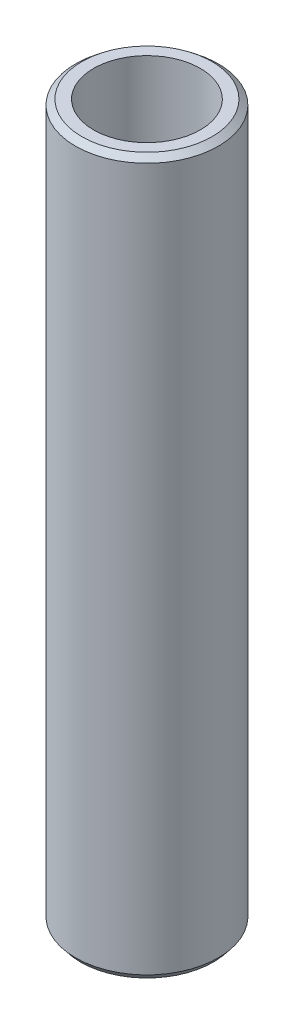
ISO-10303-21;
HEADER;
FILE_DESCRIPTION(('STEP AP214'),'2;1');
FILE_NAME('part.step','',(''),(''),'','','');
FILE_SCHEMA(('AUTOMOTIVE_DESIGN { 1 0 10303 214 1 1 1 1 }'));
ENDSEC;
DATA;
#1=APPLICATION_CONTEXT('core data for automotive mechanical design processes');
#2=APPLICATION_PROTOCOL_DEFINITION('international standard','automotive_design',2000,#1);
#3=PRODUCT_CONTEXT('',#1,'mechanical');
#4=PRODUCT('Part','Part','',(#3));
#5=PRODUCT_RELATED_PRODUCT_CATEGORY('part','',(#4));
#6=PRODUCT_DEFINITION_FORMATION('','',#4);
#7=PRODUCT_DEFINITION_CONTEXT('part definition',#1,'design');
#8=PRODUCT_DEFINITION('design','',#6,#7);
#9=PRODUCT_DEFINITION_SHAPE('','',#8);
#10=(LENGTH_UNIT() NAMED_UNIT(*) SI_UNIT(.MILLI.,.METRE.));
#11=(NAMED_UNIT(*) PLANE_ANGLE_UNIT() SI_UNIT($,.RADIAN.));
#12=(NAMED_UNIT(*) SI_UNIT($,.STERADIAN.) SOLID_ANGLE_UNIT());
#13=UNCERTAINTY_MEASURE_WITH_UNIT(LENGTH_MEASURE(1.E-05),#10,'distance_accuracy_value','');
#14=(GEOMETRIC_REPRESENTATION_CONTEXT(3) GLOBAL_UNCERTAINTY_ASSIGNED_CONTEXT((#13)) GLOBAL_UNIT_ASSIGNED_CONTEXT((#10,
#11,#12)) REPRESENTATION_CONTEXT('',''));
#15=CARTESIAN_POINT('',(0.,0.,0.));
#16=DIRECTION('',(0.,0.,1.));
#17=DIRECTION('',(1.,0.,0.));
#18=AXIS2_PLACEMENT_3D('',#15,#16,#17);
#19=CARTESIAN_POINT('',(0.,550.169340754739,0.));
#20=DIRECTION('',(0.,-1.,0.));
#21=DIRECTION('',(0.,0.,-1.));
#22=AXIS2_PLACEMENT_3D('',#19,#20,#21);
#23=CYLINDRICAL_SURFACE('',#22,55.);
#24=CARTESIAN_POINT('',(0.,546.255478460157,0.));
#25=DIRECTION('',(0.,1.,0.));
#26=DIRECTION('',(0.,0.,1.));
#27=AXIS2_PLACEMENT_3D('',#24,#25,#26);
#28=CIRCLE('',#27,55.);
#29=CARTESIAN_POINT('',(0.,546.255478460157,55.));
#30=VERTEX_POINT('',#29);
#31=EDGE_CURVE('E50',#30,#30,#28,.F.);
#32=ORIENTED_EDGE('',*,*,#31,.T.);
#33=EDGE_LOOP('',(#32));
#34=FACE_BOUND('',#33,.T.);
#35=CARTESIAN_POINT('',(0.,4.86034347771835,0.));
#36=DIRECTION('',(0.,1.,0.));
#37=DIRECTION('',(0.,0.,1.));
#38=AXIS2_PLACEMENT_3D('',#35,#36,#37);
#39=CIRCLE('',#38,55.);
#40=CARTESIAN_POINT('',(0.,4.86034347771835,55.));
#41=VERTEX_POINT('',#40);
#42=EDGE_CURVE('E51',#41,#41,#39,.T.);
#43=ORIENTED_EDGE('',*,*,#42,.T.);
#44=EDGE_LOOP('',(#43));
#45=FACE_BOUND('',#44,.T.);
#46=ADVANCED_FACE('F39',(#34,#45),#23,.T.);
#47=CARTESIAN_POINT('',(0.,550.169340754739,0.));
#48=DIRECTION('',(0.,1.,0.));
#49=DIRECTION('',(0.,0.,1.));
#50=AXIS2_PLACEMENT_3D('',#47,#48,#49);
#51=PLANE('',#50);
#52=CARTESIAN_POINT('',(0.,550.169340754739,0.));
#53=DIRECTION('',(0.,1.,0.));
#54=DIRECTION('',(0.,0.,1.));
#55=AXIS2_PLACEMENT_3D('',#52,#53,#54);
#56=CIRCLE('',#55,50.1396565222817);
#57=CARTESIAN_POINT('',(0.,550.169340754739,50.1396565222817));
#58=VERTEX_POINT('',#57);
#59=EDGE_CURVE('E54',#58,#58,#56,.T.);
#60=ORIENTED_EDGE('',*,*,#59,.T.);
#61=EDGE_LOOP('',(#60));
#62=FACE_BOUND('',#61,.T.);
#63=CARTESIAN_POINT('',(0.,550.169340754739,0.));
#64=DIRECTION('',(0.,1.,0.));
#65=DIRECTION('',(0.,0.,1.));
#66=AXIS2_PLACEMENT_3D('',#63,#64,#65);
#67=CIRCLE('',#66,41.0896435304594);
#68=CARTESIAN_POINT('',(0.,550.169340754739,41.0896435304594));
#69=VERTEX_POINT('',#68);
#70=EDGE_CURVE('E58',#69,#69,#67,.T.);
#71=ORIENTED_EDGE('',*,*,#70,.F.);
#72=EDGE_LOOP('',(#71));
#73=FACE_BOUND('',#72,.T.);
#74=ADVANCED_FACE('F69',(#62,#73),#51,.T.);
#75=CARTESIAN_POINT('',(0.,0.,0.));
#76=DIRECTION('',(0.,1.,0.));
#77=DIRECTION('',(0.,0.,1.));
#78=AXIS2_PLACEMENT_3D('',#75,#76,#77);
#79=PLANE('',#78);
#80=CARTESIAN_POINT('',(0.,0.,0.));
#81=DIRECTION('',(0.,1.,0.));
#82=DIRECTION('',(0.,0.,1.));
#83=AXIS2_PLACEMENT_3D('',#80,#81,#82);
#84=CIRCLE('',#83,51.0861377054186);
#85=CARTESIAN_POINT('',(0.,0.,51.0861377054186));
#86=VERTEX_POINT('',#85);
#87=EDGE_CURVE('E10',#86,#86,#84,.F.);
#88=ORIENTED_EDGE('',*,*,#87,.T.);
#89=EDGE_LOOP('',(#88));
#90=FACE_BOUND('',#89,.T.);
#91=CARTESIAN_POINT('',(0.,0.,0.));
#92=DIRECTION('',(0.,1.,0.));
#93=DIRECTION('',(0.,0.,1.));
#94=AXIS2_PLACEMENT_3D('',#91,#92,#93);
#95=CIRCLE('',#94,41.0896435304594);
#96=CARTESIAN_POINT('',(0.,0.,41.0896435304594));
#97=VERTEX_POINT('',#96);
#98=EDGE_CURVE('E63',#97,#97,#95,.T.);
#99=ORIENTED_EDGE('',*,*,#98,.T.);
#100=EDGE_LOOP('',(#99));
#101=FACE_BOUND('',#100,.T.);
#102=ADVANCED_FACE('F75',(#90,#101),#79,.F.);
#103=CARTESIAN_POINT('',(0.,550.169340754739,0.));
#104=DIRECTION('',(0.,-1.,0.));
#105=DIRECTION('',(0.,0.,-1.));
#106=AXIS2_PLACEMENT_3D('',#103,#104,#105);
#107=CYLINDRICAL_SURFACE('',#106,41.0896435304594);
#108=ORIENTED_EDGE('',*,*,#70,.T.);
#109=EDGE_LOOP('',(#108));
#110=FACE_BOUND('',#109,.T.);
#111=ORIENTED_EDGE('',*,*,#98,.F.);
#112=EDGE_LOOP('',(#111));
#113=FACE_BOUND('',#112,.T.);
#114=ADVANCED_FACE('F70',(#110,#113),#107,.F.);
#115=CARTESIAN_POINT('',(0.,550.169340754739,0.));
#116=DIRECTION('',(0.,-1.,0.));
#117=DIRECTION('',(0.,0.,-1.));
#118=AXIS2_PLACEMENT_3D('',#115,#116,#117);
#119=CONICAL_SURFACE('',#118,50.1396565222817,0.892853527787568);
#120=ORIENTED_EDGE('',*,*,#31,.F.);
#121=EDGE_LOOP('',(#120));
#122=FACE_BOUND('',#121,.T.);
#123=ORIENTED_EDGE('',*,*,#59,.F.);
#124=EDGE_LOOP('',(#123));
#125=FACE_BOUND('',#124,.T.);
#126=ADVANCED_FACE('F81',(#122,#125),#119,.T.);
#127=CARTESIAN_POINT('',(0.,4.86034347771835,0.));
#128=DIRECTION('',(0.,1.,0.));
#129=DIRECTION('',(0.,0.,1.));
#130=AXIS2_PLACEMENT_3D('',#127,#128,#129);
#131=CONICAL_SURFACE('',#130,55.,0.677942799007333);
#132=ORIENTED_EDGE('',*,*,#87,.F.);
#133=EDGE_LOOP('',(#132));
#134=FACE_BOUND('',#133,.T.);
#135=ORIENTED_EDGE('',*,*,#42,.F.);
#136=EDGE_LOOP('',(#135));
#137=FACE_BOUND('',#136,.T.);
#138=ADVANCED_FACE('F45',(#134,#137),#131,.T.);
#139=CLOSED_SHELL('',(#46,#74,#102,#114,#126,#138));
#140=MANIFOLD_SOLID_BREP('B2',#139);
#141=ADVANCED_BREP_SHAPE_REPRESENTATION('',(#18,#140),#14);
#142=SHAPE_DEFINITION_REPRESENTATION(#9,#141);
ENDSEC;
END-ISO-10303-21;
